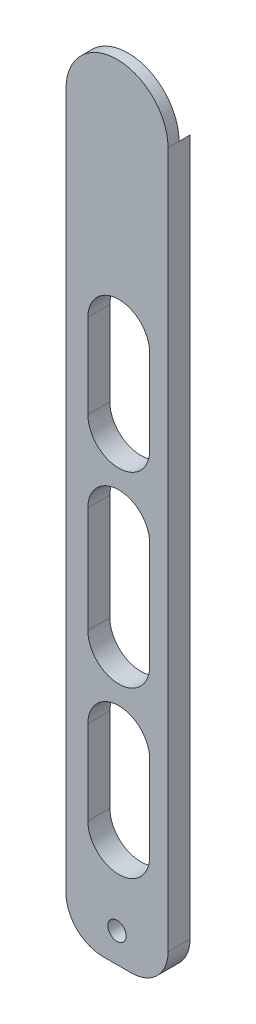
ISO-10303-21;
HEADER;
FILE_DESCRIPTION(('STEP AP214'),'2;1');
FILE_NAME('part.step','',(''),(''),'','','');
FILE_SCHEMA(('AUTOMOTIVE_DESIGN { 1 0 10303 214 1 1 1 1 }'));
ENDSEC;
DATA;
#1=APPLICATION_CONTEXT('core data for automotive mechanical design processes');
#2=APPLICATION_PROTOCOL_DEFINITION('international standard','automotive_design',2000,#1);
#3=PRODUCT_CONTEXT('',#1,'mechanical');
#4=PRODUCT('Part','Part','',(#3));
#5=PRODUCT_RELATED_PRODUCT_CATEGORY('part','',(#4));
#6=PRODUCT_DEFINITION_FORMATION('','',#4);
#7=PRODUCT_DEFINITION_CONTEXT('part definition',#1,'design');
#8=PRODUCT_DEFINITION('design','',#6,#7);
#9=PRODUCT_DEFINITION_SHAPE('','',#8);
#10=(LENGTH_UNIT() NAMED_UNIT(*) SI_UNIT(.MILLI.,.METRE.));
#11=(NAMED_UNIT(*) PLANE_ANGLE_UNIT() SI_UNIT($,.RADIAN.));
#12=(NAMED_UNIT(*) SI_UNIT($,.STERADIAN.) SOLID_ANGLE_UNIT());
#13=UNCERTAINTY_MEASURE_WITH_UNIT(LENGTH_MEASURE(1.E-05),#10,'distance_accuracy_value','');
#14=(GEOMETRIC_REPRESENTATION_CONTEXT(3) GLOBAL_UNCERTAINTY_ASSIGNED_CONTEXT((#13)) GLOBAL_UNIT_ASSIGNED_CONTEXT((#10,
#11,#12)) REPRESENTATION_CONTEXT('',''));
#15=CARTESIAN_POINT('',(0.,0.,0.));
#16=DIRECTION('',(0.,0.,1.));
#17=DIRECTION('',(1.,0.,0.));
#18=AXIS2_PLACEMENT_3D('',#15,#16,#17);
#19=CARTESIAN_POINT('',(0.186190476190486,-158.237738095238,6.));
#20=DIRECTION('',(0.,0.,1.));
#21=DIRECTION('',(1.,0.,0.));
#22=AXIS2_PLACEMENT_3D('',#19,#20,#21);
#23=CYLINDRICAL_SURFACE('',#22,10.);
#24=DIRECTION('',(0.,0.,1.));
#25=VECTOR('',#24,1.);
#26=CARTESIAN_POINT('',(-9.81380952380951,-158.237738095238,6.));
#27=LINE('',#26,#25);
#28=CARTESIAN_POINT('',(-9.81380952380951,-158.237738095238,0.));
#29=VERTEX_POINT('',#28);
#30=CARTESIAN_POINT('',(-9.81380952380951,-158.237738095238,6.));
#31=VERTEX_POINT('',#30);
#32=EDGE_CURVE('E318',#29,#31,#27,.T.);
#33=ORIENTED_EDGE('',*,*,#32,.F.);
#34=CARTESIAN_POINT('',(0.186190476190486,-158.237738095238,0.));
#35=DIRECTION('',(0.,0.,1.));
#36=DIRECTION('',(1.,0.,0.));
#37=AXIS2_PLACEMENT_3D('',#34,#35,#36);
#38=CIRCLE('',#37,10.);
#39=CARTESIAN_POINT('',(0.186190476190486,-168.237738095238,0.));
#40=VERTEX_POINT('',#39);
#41=EDGE_CURVE('E42',#40,#29,#38,.F.);
#42=ORIENTED_EDGE('',*,*,#41,.F.);
#43=DIRECTION('',(0.,0.,1.));
#44=VECTOR('',#43,1.);
#45=CARTESIAN_POINT('',(0.186190476190486,-168.237738095238,6.));
#46=LINE('',#45,#44);
#47=CARTESIAN_POINT('',(0.186190476190486,-168.237738095238,6.));
#48=VERTEX_POINT('',#47);
#49=EDGE_CURVE('E321',#48,#40,#46,.F.);
#50=ORIENTED_EDGE('',*,*,#49,.F.);
#51=CARTESIAN_POINT('',(0.186190476190486,-158.237738095238,6.));
#52=DIRECTION('',(0.,0.,1.));
#53=DIRECTION('',(1.,0.,0.));
#54=AXIS2_PLACEMENT_3D('',#51,#52,#53);
#55=CIRCLE('',#54,10.);
#56=EDGE_CURVE('E11',#31,#48,#55,.T.);
#57=ORIENTED_EDGE('',*,*,#56,.F.);
#58=EDGE_LOOP('',(#33,#42,#50,#57));
#59=FACE_BOUND('',#58,.T.);
#60=ADVANCED_FACE('F35',(#59),#23,.T.);
#61=CARTESIAN_POINT('',(8.03619047619048,-158.237738095238,6.));
#62=DIRECTION('',(0.,0.,-1.));
#63=DIRECTION('',(-1.,0.,0.));
#64=AXIS2_PLACEMENT_3D('',#61,#62,#63);
#65=CYLINDRICAL_SURFACE('',#64,10.);
#66=DIRECTION('',(0.,0.,1.));
#67=VECTOR('',#66,1.);
#68=CARTESIAN_POINT('',(8.03619047619048,-168.237738095238,6.));
#69=LINE('',#68,#67);
#70=CARTESIAN_POINT('',(8.03619047619048,-168.237738095238,0.));
#71=VERTEX_POINT('',#70);
#72=CARTESIAN_POINT('',(8.03619047619048,-168.237738095238,6.));
#73=VERTEX_POINT('',#72);
#74=EDGE_CURVE('E307',#71,#73,#69,.T.);
#75=ORIENTED_EDGE('',*,*,#74,.F.);
#76=CARTESIAN_POINT('',(8.03619047619048,-158.237738095238,0.));
#77=DIRECTION('',(0.,0.,1.));
#78=DIRECTION('',(1.,0.,0.));
#79=AXIS2_PLACEMENT_3D('',#76,#77,#78);
#80=CIRCLE('',#79,10.);
#81=CARTESIAN_POINT('',(18.0361904761905,-158.237738095238,0.));
#82=VERTEX_POINT('',#81);
#83=EDGE_CURVE('E313',#82,#71,#80,.F.);
#84=ORIENTED_EDGE('',*,*,#83,.F.);
#85=DIRECTION('',(0.,0.,1.));
#86=VECTOR('',#85,1.);
#87=CARTESIAN_POINT('',(18.0361904761905,-158.237738095238,6.));
#88=LINE('',#87,#86);
#89=CARTESIAN_POINT('',(18.0361904761905,-158.237738095238,6.));
#90=VERTEX_POINT('',#89);
#91=EDGE_CURVE('E310',#90,#82,#88,.F.);
#92=ORIENTED_EDGE('',*,*,#91,.F.);
#93=CARTESIAN_POINT('',(8.03619047619048,-158.237738095238,6.));
#94=DIRECTION('',(0.,0.,1.));
#95=DIRECTION('',(1.,0.,0.));
#96=AXIS2_PLACEMENT_3D('',#93,#94,#95);
#97=CIRCLE('',#96,10.);
#98=EDGE_CURVE('E316',#73,#90,#97,.T.);
#99=ORIENTED_EDGE('',*,*,#98,.F.);
#100=EDGE_LOOP('',(#75,#84,#92,#99));
#101=FACE_BOUND('',#100,.T.);
#102=ADVANCED_FACE('F348',(#101),#65,.T.);
#103=CARTESIAN_POINT('',(0.,0.,6.));
#104=DIRECTION('',(0.,0.,1.));
#105=DIRECTION('',(1.,0.,0.));
#106=AXIS2_PLACEMENT_3D('',#103,#104,#105);
#107=PLANE('',#106);
#108=CARTESIAN_POINT('',(4.60119047619047,-93.2377380952381,6.));
#109=DIRECTION('',(0.,0.,1.));
#110=DIRECTION('',(1.,0.,0.));
#111=AXIS2_PLACEMENT_3D('',#108,#109,#110);
#112=CIRCLE('',#111,8.435);
#113=CARTESIAN_POINT('',(-3.83380952380953,-93.2377380952381,6.));
#114=VERTEX_POINT('',#113);
#115=CARTESIAN_POINT('',(13.0361904761905,-93.2377380952381,6.));
#116=VERTEX_POINT('',#115);
#117=EDGE_CURVE('E232',#114,#116,#112,.T.);
#118=ORIENTED_EDGE('',*,*,#117,.F.);
#119=DIRECTION('',(0.,-1.,0.));
#120=VECTOR('',#119,1.);
#121=CARTESIAN_POINT('',(-3.83380952380953,0.,6.));
#122=LINE('',#121,#120);
#123=CARTESIAN_POINT('',(-3.83380952380953,-64.2377380952381,6.));
#124=VERTEX_POINT('',#123);
#125=EDGE_CURVE('E218',#124,#114,#122,.T.);
#126=ORIENTED_EDGE('',*,*,#125,.F.);
#127=CARTESIAN_POINT('',(4.60119047619047,-64.2377380952381,6.));
#128=DIRECTION('',(0.,0.,1.));
#129=DIRECTION('',(1.,0.,0.));
#130=AXIS2_PLACEMENT_3D('',#127,#128,#129);
#131=CIRCLE('',#130,8.435);
#132=CARTESIAN_POINT('',(13.0361904761905,-64.2377380952381,6.));
#133=VERTEX_POINT('',#132);
#134=EDGE_CURVE('E226',#133,#124,#131,.T.);
#135=ORIENTED_EDGE('',*,*,#134,.F.);
#136=DIRECTION('',(0.,-1.,0.));
#137=VECTOR('',#136,1.);
#138=CARTESIAN_POINT('',(13.0361904761905,0.,6.));
#139=LINE('',#138,#137);
#140=EDGE_CURVE('E229',#133,#116,#139,.T.);
#141=ORIENTED_EDGE('',*,*,#140,.T.);
#142=EDGE_LOOP('',(#118,#126,#135,#141));
#143=FACE_BOUND('',#142,.T.);
#144=CARTESIAN_POINT('',(4.11119047619046,-160.237738095238,6.));
#145=DIRECTION('',(0.,0.,1.));
#146=DIRECTION('',(1.,0.,0.));
#147=AXIS2_PLACEMENT_3D('',#144,#145,#146);
#148=CIRCLE('',#147,2.5);
#149=CARTESIAN_POINT('',(6.61119047619046,-160.237738095238,6.));
#150=VERTEX_POINT('',#149);
#151=EDGE_CURVE('E275',#150,#150,#148,.T.);
#152=ORIENTED_EDGE('',*,*,#151,.F.);
#153=EDGE_LOOP('',(#152));
#154=FACE_BOUND('',#153,.T.);
#155=DIRECTION('',(0.,-1.,0.));
#156=VECTOR('',#155,1.);
#157=CARTESIAN_POINT('',(-9.81380952380953,0.,6.));
#158=LINE('',#157,#156);
#159=CARTESIAN_POINT('',(-9.81380952380954,31.7622619047619,6.));
#160=VERTEX_POINT('',#159);
#161=EDGE_CURVE('E285',#160,#31,#158,.T.);
#162=ORIENTED_EDGE('',*,*,#161,.T.);
#163=ORIENTED_EDGE('',*,*,#56,.T.);
#164=DIRECTION('',(1.,0.,0.));
#165=VECTOR('',#164,1.);
#166=CARTESIAN_POINT('',(0.,-168.237738095238,6.));
#167=LINE('',#166,#165);
#168=EDGE_CURVE('E287',#48,#73,#167,.T.);
#169=ORIENTED_EDGE('',*,*,#168,.T.);
#170=ORIENTED_EDGE('',*,*,#98,.T.);
#171=DIRECTION('',(0.,-1.,0.));
#172=VECTOR('',#171,1.);
#173=CARTESIAN_POINT('',(18.0361904761905,0.,6.));
#174=LINE('',#173,#172);
#175=CARTESIAN_POINT('',(18.0361904761905,31.7622619047619,6.));
#176=VERTEX_POINT('',#175);
#177=EDGE_CURVE('E279',#176,#90,#174,.T.);
#178=ORIENTED_EDGE('',*,*,#177,.F.);
#179=CARTESIAN_POINT('',(4.11119047619046,31.7622619047619,6.));
#180=DIRECTION('',(0.,0.,1.));
#181=DIRECTION('',(1.,0.,0.));
#182=AXIS2_PLACEMENT_3D('',#179,#180,#181);
#183=CIRCLE('',#182,13.925);
#184=EDGE_CURVE('E282',#176,#160,#183,.T.);
#185=ORIENTED_EDGE('',*,*,#184,.T.);
#186=EDGE_LOOP('',(#162,#163,#169,#170,#178,#185));
#187=FACE_BOUND('',#186,.T.);
#188=DIRECTION('',(0.,1.,0.));
#189=VECTOR('',#188,1.);
#190=CARTESIAN_POINT('',(-3.83380952380953,0.,6.));
#191=LINE('',#190,#189);
#192=CARTESIAN_POINT('',(-3.83380952380953,-138.237738095238,6.));
#193=VERTEX_POINT('',#192);
#194=CARTESIAN_POINT('',(-3.83380952380953,-115.237738095238,6.));
#195=VERTEX_POINT('',#194);
#196=EDGE_CURVE('E260',#193,#195,#191,.T.);
#197=ORIENTED_EDGE('',*,*,#196,.T.);
#198=CARTESIAN_POINT('',(4.60119047619047,-115.237738095238,6.));
#199=DIRECTION('',(0.,0.,1.));
#200=DIRECTION('',(1.,0.,0.));
#201=AXIS2_PLACEMENT_3D('',#198,#199,#200);
#202=CIRCLE('',#201,8.435);
#203=CARTESIAN_POINT('',(13.0361904761905,-115.237738095238,6.));
#204=VERTEX_POINT('',#203);
#205=EDGE_CURVE('E263',#195,#204,#202,.F.);
#206=ORIENTED_EDGE('',*,*,#205,.T.);
#207=DIRECTION('',(0.,1.,0.));
#208=VECTOR('',#207,1.);
#209=CARTESIAN_POINT('',(13.0361904761904,0.,6.));
#210=LINE('',#209,#208);
#211=CARTESIAN_POINT('',(13.0361904761905,-138.237738095238,6.));
#212=VERTEX_POINT('',#211);
#213=EDGE_CURVE('E249',#212,#204,#210,.T.);
#214=ORIENTED_EDGE('',*,*,#213,.F.);
#215=CARTESIAN_POINT('',(4.60119047619047,-138.237738095238,6.));
#216=DIRECTION('',(0.,0.,1.));
#217=DIRECTION('',(1.,0.,0.));
#218=AXIS2_PLACEMENT_3D('',#215,#216,#217);
#219=CIRCLE('',#218,8.435);
#220=EDGE_CURVE('E257',#193,#212,#219,.T.);
#221=ORIENTED_EDGE('',*,*,#220,.F.);
#222=EDGE_LOOP('',(#197,#206,#214,#221));
#223=FACE_BOUND('',#222,.T.);
#224=DIRECTION('',(0.,1.,0.));
#225=VECTOR('',#224,1.);
#226=CARTESIAN_POINT('',(13.0361904761905,0.,6.));
#227=LINE('',#226,#225);
#228=CARTESIAN_POINT('',(13.0361904761905,-42.2377380952381,6.));
#229=VERTEX_POINT('',#228);
#230=CARTESIAN_POINT('',(13.0361904761905,-19.2377380952381,6.));
#231=VERTEX_POINT('',#230);
#232=EDGE_CURVE('E199',#229,#231,#227,.T.);
#233=ORIENTED_EDGE('',*,*,#232,.F.);
#234=CARTESIAN_POINT('',(4.60119047619047,-42.2377380952381,6.));
#235=DIRECTION('',(0.,0.,1.));
#236=DIRECTION('',(1.,0.,0.));
#237=AXIS2_PLACEMENT_3D('',#234,#235,#236);
#238=CIRCLE('',#237,8.435);
#239=CARTESIAN_POINT('',(-3.83380952380954,-42.2377380952381,6.));
#240=VERTEX_POINT('',#239);
#241=EDGE_CURVE('E201',#229,#240,#238,.F.);
#242=ORIENTED_EDGE('',*,*,#241,.T.);
#243=DIRECTION('',(0.,1.,0.));
#244=VECTOR('',#243,1.);
#245=CARTESIAN_POINT('',(-3.83380952380953,0.,6.));
#246=LINE('',#245,#244);
#247=CARTESIAN_POINT('',(-3.83380952380953,-19.2377380952381,6.));
#248=VERTEX_POINT('',#247);
#249=EDGE_CURVE('E194',#240,#248,#246,.T.);
#250=ORIENTED_EDGE('',*,*,#249,.T.);
#251=CARTESIAN_POINT('',(4.60119047619047,-19.2377380952381,6.));
#252=DIRECTION('',(0.,0.,1.));
#253=DIRECTION('',(1.,0.,0.));
#254=AXIS2_PLACEMENT_3D('',#251,#252,#253);
#255=CIRCLE('',#254,8.435);
#256=EDGE_CURVE('E170',#231,#248,#255,.T.);
#257=ORIENTED_EDGE('',*,*,#256,.F.);
#258=EDGE_LOOP('',(#233,#242,#250,#257));
#259=FACE_BOUND('',#258,.T.);
#260=ADVANCED_FACE('F352',(#143,#154,#187,#223,#259),#107,.T.);
#261=CARTESIAN_POINT('',(0.,0.,0.));
#262=DIRECTION('',(0.,0.,1.));
#263=DIRECTION('',(1.,0.,0.));
#264=AXIS2_PLACEMENT_3D('',#261,#262,#263);
#265=PLANE('',#264);
#266=CARTESIAN_POINT('',(4.60119047619047,-115.237738095238,0.));
#267=DIRECTION('',(0.,0.,-1.));
#268=DIRECTION('',(-1.,0.,0.));
#269=AXIS2_PLACEMENT_3D('',#266,#267,#268);
#270=CIRCLE('',#269,8.435);
#271=CARTESIAN_POINT('',(13.0361904761905,-115.237738095238,0.));
#272=VERTEX_POINT('',#271);
#273=CARTESIAN_POINT('',(-3.83380952380953,-115.237738095238,0.));
#274=VERTEX_POINT('',#273);
#275=EDGE_CURVE('E234',#272,#274,#270,.F.);
#276=ORIENTED_EDGE('',*,*,#275,.T.);
#277=DIRECTION('',(0.,-1.,0.));
#278=VECTOR('',#277,1.);
#279=CARTESIAN_POINT('',(-3.83380952380953,0.,0.));
#280=LINE('',#279,#278);
#281=CARTESIAN_POINT('',(-3.83380952380953,-138.237738095238,0.));
#282=VERTEX_POINT('',#281);
#283=EDGE_CURVE('E243',#274,#282,#280,.T.);
#284=ORIENTED_EDGE('',*,*,#283,.T.);
#285=CARTESIAN_POINT('',(4.60119047619047,-138.237738095238,0.));
#286=DIRECTION('',(0.,0.,-1.));
#287=DIRECTION('',(-1.,0.,0.));
#288=AXIS2_PLACEMENT_3D('',#285,#286,#287);
#289=CIRCLE('',#288,8.435);
#290=CARTESIAN_POINT('',(13.0361904761905,-138.237738095238,0.));
#291=VERTEX_POINT('',#290);
#292=EDGE_CURVE('E240',#291,#282,#289,.T.);
#293=ORIENTED_EDGE('',*,*,#292,.F.);
#294=DIRECTION('',(0.,-1.,0.));
#295=VECTOR('',#294,1.);
#296=CARTESIAN_POINT('',(13.0361904761904,0.,0.));
#297=LINE('',#296,#295);
#298=EDGE_CURVE('E237',#272,#291,#297,.T.);
#299=ORIENTED_EDGE('',*,*,#298,.F.);
#300=EDGE_LOOP('',(#276,#284,#293,#299));
#301=FACE_BOUND('',#300,.T.);
#302=CARTESIAN_POINT('',(4.11119047619046,-160.237738095238,0.));
#303=DIRECTION('',(0.,0.,1.));
#304=DIRECTION('',(1.,0.,0.));
#305=AXIS2_PLACEMENT_3D('',#302,#303,#304);
#306=CIRCLE('',#305,2.5);
#307=CARTESIAN_POINT('',(6.61119047619046,-160.237738095238,0.));
#308=VERTEX_POINT('',#307);
#309=EDGE_CURVE('E278',#308,#308,#306,.T.);
#310=ORIENTED_EDGE('',*,*,#309,.T.);
#311=EDGE_LOOP('',(#310));
#312=FACE_BOUND('',#311,.T.);
#313=DIRECTION('',(1.,0.,0.));
#314=VECTOR('',#313,1.);
#315=CARTESIAN_POINT('',(0.,-168.237738095238,0.));
#316=LINE('',#315,#314);
#317=EDGE_CURVE('E283',#40,#71,#316,.T.);
#318=ORIENTED_EDGE('',*,*,#317,.F.);
#319=ORIENTED_EDGE('',*,*,#41,.T.);
#320=DIRECTION('',(0.,-1.,0.));
#321=VECTOR('',#320,1.);
#322=CARTESIAN_POINT('',(-9.81380952380953,0.,0.));
#323=LINE('',#322,#321);
#324=CARTESIAN_POINT('',(-9.81380952380954,31.7622619047619,0.));
#325=VERTEX_POINT('',#324);
#326=EDGE_CURVE('E293',#325,#29,#323,.T.);
#327=ORIENTED_EDGE('',*,*,#326,.F.);
#328=CARTESIAN_POINT('',(4.11119047619046,31.7622619047619,0.));
#329=DIRECTION('',(0.,0.,1.));
#330=DIRECTION('',(1.,0.,0.));
#331=AXIS2_PLACEMENT_3D('',#328,#329,#330);
#332=CIRCLE('',#331,13.925);
#333=CARTESIAN_POINT('',(18.0361904761905,31.7622619047619,0.));
#334=VERTEX_POINT('',#333);
#335=EDGE_CURVE('E302',#325,#334,#332,.T.);
#336=ORIENTED_EDGE('',*,*,#335,.T.);
#337=DIRECTION('',(0.,-1.,0.));
#338=VECTOR('',#337,1.);
#339=CARTESIAN_POINT('',(18.0361904761905,0.,0.));
#340=LINE('',#339,#338);
#341=EDGE_CURVE('E290',#334,#82,#340,.T.);
#342=ORIENTED_EDGE('',*,*,#341,.T.);
#343=ORIENTED_EDGE('',*,*,#83,.T.);
#344=EDGE_LOOP('',(#318,#319,#327,#336,#342,#343));
#345=FACE_BOUND('',#344,.T.);
#346=DIRECTION('',(0.,1.,0.));
#347=VECTOR('',#346,1.);
#348=CARTESIAN_POINT('',(-3.83380952380953,0.,0.));
#349=LINE('',#348,#347);
#350=CARTESIAN_POINT('',(-3.83380952380953,-93.2377380952381,0.));
#351=VERTEX_POINT('',#350);
#352=CARTESIAN_POINT('',(-3.83380952380953,-64.2377380952381,0.));
#353=VERTEX_POINT('',#352);
#354=EDGE_CURVE('E206',#351,#353,#349,.T.);
#355=ORIENTED_EDGE('',*,*,#354,.F.);
#356=CARTESIAN_POINT('',(4.60119047619047,-93.2377380952381,0.));
#357=DIRECTION('',(0.,0.,-1.));
#358=DIRECTION('',(-1.,0.,0.));
#359=AXIS2_PLACEMENT_3D('',#356,#357,#358);
#360=CIRCLE('',#359,8.435);
#361=CARTESIAN_POINT('',(13.0361904761905,-93.2377380952381,0.));
#362=VERTEX_POINT('',#361);
#363=EDGE_CURVE('E204',#362,#351,#360,.T.);
#364=ORIENTED_EDGE('',*,*,#363,.F.);
#365=DIRECTION('',(0.,1.,0.));
#366=VECTOR('',#365,1.);
#367=CARTESIAN_POINT('',(13.0361904761905,0.,0.));
#368=LINE('',#367,#366);
#369=CARTESIAN_POINT('',(13.0361904761905,-64.2377380952381,0.));
#370=VERTEX_POINT('',#369);
#371=EDGE_CURVE('E212',#362,#370,#368,.T.);
#372=ORIENTED_EDGE('',*,*,#371,.T.);
#373=CARTESIAN_POINT('',(4.60119047619047,-64.2377380952381,0.));
#374=DIRECTION('',(0.,0.,-1.));
#375=DIRECTION('',(-1.,0.,0.));
#376=AXIS2_PLACEMENT_3D('',#373,#374,#375);
#377=CIRCLE('',#376,8.435);
#378=EDGE_CURVE('E209',#353,#370,#377,.T.);
#379=ORIENTED_EDGE('',*,*,#378,.F.);
#380=EDGE_LOOP('',(#355,#364,#372,#379));
#381=FACE_BOUND('',#380,.T.);
#382=CARTESIAN_POINT('',(4.60119047619047,-42.2377380952381,0.));
#383=DIRECTION('',(0.,0.,-1.));
#384=DIRECTION('',(-1.,0.,0.));
#385=AXIS2_PLACEMENT_3D('',#382,#383,#384);
#386=CIRCLE('',#385,8.435);
#387=CARTESIAN_POINT('',(-3.83380952380954,-42.2377380952381,0.));
#388=VERTEX_POINT('',#387);
#389=CARTESIAN_POINT('',(13.0361904761905,-42.2377380952381,0.));
#390=VERTEX_POINT('',#389);
#391=EDGE_CURVE('E183',#388,#390,#386,.F.);
#392=ORIENTED_EDGE('',*,*,#391,.T.);
#393=DIRECTION('',(0.,-1.,0.));
#394=VECTOR('',#393,1.);
#395=CARTESIAN_POINT('',(13.0361904761905,0.,0.));
#396=LINE('',#395,#394);
#397=CARTESIAN_POINT('',(13.0361904761905,-19.2377380952381,0.));
#398=VERTEX_POINT('',#397);
#399=EDGE_CURVE('E187',#398,#390,#396,.T.);
#400=ORIENTED_EDGE('',*,*,#399,.F.);
#401=CARTESIAN_POINT('',(4.60119047619047,-19.2377380952381,0.));
#402=DIRECTION('',(0.,0.,-1.));
#403=DIRECTION('',(-1.,0.,0.));
#404=AXIS2_PLACEMENT_3D('',#401,#402,#403);
#405=CIRCLE('',#404,8.435);
#406=CARTESIAN_POINT('',(-3.83380952380953,-19.2377380952381,0.));
#407=VERTEX_POINT('',#406);
#408=EDGE_CURVE('E167',#407,#398,#405,.T.);
#409=ORIENTED_EDGE('',*,*,#408,.F.);
#410=DIRECTION('',(0.,-1.,0.));
#411=VECTOR('',#410,1.);
#412=CARTESIAN_POINT('',(-3.83380952380953,0.,0.));
#413=LINE('',#412,#411);
#414=EDGE_CURVE('E178',#407,#388,#413,.T.);
#415=ORIENTED_EDGE('',*,*,#414,.T.);
#416=EDGE_LOOP('',(#392,#400,#409,#415));
#417=FACE_BOUND('',#416,.T.);
#418=ADVANCED_FACE('F185',(#301,#312,#345,#381,#417),#265,.F.);
#419=CARTESIAN_POINT('',(4.11119047619046,31.7622619047619,6.));
#420=DIRECTION('',(0.,0.,-1.));
#421=DIRECTION('',(-1.,0.,0.));
#422=AXIS2_PLACEMENT_3D('',#419,#420,#421);
#423=CYLINDRICAL_SURFACE('',#422,13.925);
#424=CARTESIAN_POINT('',(4.11119047619046,31.7622619047619,3.));
#425=DIRECTION('',(0.,0.,-1.));
#426=DIRECTION('',(-1.,0.,0.));
#427=AXIS2_PLACEMENT_3D('',#424,#425,#426);
#428=CIRCLE('',#427,13.925);
#429=CARTESIAN_POINT('',(-9.81380952380954,31.7622619047619,3.));
#430=VERTEX_POINT('',#429);
#431=CARTESIAN_POINT('',(18.0361904761905,31.7622619047619,3.));
#432=VERTEX_POINT('',#431);
#433=EDGE_CURVE('E267',#430,#432,#428,.T.);
#434=ORIENTED_EDGE('',*,*,#433,.F.);
#435=DIRECTION('',(0.,0.,-1.));
#436=VECTOR('',#435,1.);
#437=CARTESIAN_POINT('',(-9.81380952380954,31.7622619047619,6.));
#438=LINE('',#437,#436);
#439=EDGE_CURVE('E289',#160,#430,#438,.T.);
#440=ORIENTED_EDGE('',*,*,#439,.F.);
#441=ORIENTED_EDGE('',*,*,#184,.F.);
#442=DIRECTION('',(0.,0.,-1.));
#443=VECTOR('',#442,1.);
#444=CARTESIAN_POINT('',(18.0361904761905,31.7622619047619,6.));
#445=LINE('',#444,#443);
#446=EDGE_CURVE('E299',#176,#432,#445,.T.);
#447=ORIENTED_EDGE('',*,*,#446,.T.);
#448=EDGE_LOOP('',(#434,#440,#441,#447));
#449=FACE_BOUND('',#448,.T.);
#450=ADVANCED_FACE('F338',(#449),#423,.T.);
#451=CARTESIAN_POINT('',(18.0361904761905,0.,6.));
#452=DIRECTION('',(1.,0.,0.));
#453=DIRECTION('',(0.,1.,0.));
#454=AXIS2_PLACEMENT_3D('',#451,#452,#453);
#455=PLANE('',#454);
#456=ORIENTED_EDGE('',*,*,#177,.T.);
#457=ORIENTED_EDGE('',*,*,#91,.T.);
#458=ORIENTED_EDGE('',*,*,#341,.F.);
#459=DIRECTION('',(0.,0.,-1.));
#460=VECTOR('',#459,1.);
#461=CARTESIAN_POINT('',(18.0361904761905,31.7622619047619,3.));
#462=LINE('',#461,#460);
#463=EDGE_CURVE('E273',#432,#334,#462,.T.);
#464=ORIENTED_EDGE('',*,*,#463,.F.);
#465=ORIENTED_EDGE('',*,*,#446,.F.);
#466=EDGE_LOOP('',(#456,#457,#458,#464,#465));
#467=FACE_BOUND('',#466,.T.);
#468=ADVANCED_FACE('F342',(#467),#455,.T.);
#469=CARTESIAN_POINT('',(-9.81380952380953,0.,6.));
#470=DIRECTION('',(1.,0.,0.));
#471=DIRECTION('',(0.,1.,0.));
#472=AXIS2_PLACEMENT_3D('',#469,#470,#471);
#473=PLANE('',#472);
#474=ORIENTED_EDGE('',*,*,#326,.T.);
#475=ORIENTED_EDGE('',*,*,#32,.T.);
#476=ORIENTED_EDGE('',*,*,#161,.F.);
#477=ORIENTED_EDGE('',*,*,#439,.T.);
#478=DIRECTION('',(0.,0.,-1.));
#479=VECTOR('',#478,1.);
#480=CARTESIAN_POINT('',(-9.81380952380954,31.7622619047619,3.));
#481=LINE('',#480,#479);
#482=EDGE_CURVE('E270',#430,#325,#481,.T.);
#483=ORIENTED_EDGE('',*,*,#482,.T.);
#484=EDGE_LOOP('',(#474,#475,#476,#477,#483));
#485=FACE_BOUND('',#484,.T.);
#486=ADVANCED_FACE('F328',(#485),#473,.F.);
#487=CARTESIAN_POINT('',(0.,-168.237738095238,6.));
#488=DIRECTION('',(0.,1.,0.));
#489=DIRECTION('',(0.,0.,1.));
#490=AXIS2_PLACEMENT_3D('',#487,#488,#489);
#491=PLANE('',#490);
#492=ORIENTED_EDGE('',*,*,#168,.F.);
#493=ORIENTED_EDGE('',*,*,#49,.T.);
#494=ORIENTED_EDGE('',*,*,#317,.T.);
#495=ORIENTED_EDGE('',*,*,#74,.T.);
#496=EDGE_LOOP('',(#492,#493,#494,#495));
#497=FACE_BOUND('',#496,.T.);
#498=ADVANCED_FACE('F351',(#497),#491,.F.);
#499=CARTESIAN_POINT('',(4.11119047619046,-160.237738095238,-23.));
#500=DIRECTION('',(0.,0.,1.));
#501=DIRECTION('',(1.,0.,0.));
#502=AXIS2_PLACEMENT_3D('',#499,#500,#501);
#503=CYLINDRICAL_SURFACE('',#502,2.5);
#504=ORIENTED_EDGE('',*,*,#151,.T.);
#505=EDGE_LOOP('',(#504));
#506=FACE_BOUND('',#505,.T.);
#507=ORIENTED_EDGE('',*,*,#309,.F.);
#508=EDGE_LOOP('',(#507));
#509=FACE_BOUND('',#508,.T.);
#510=ADVANCED_FACE('F395',(#506,#509),#503,.F.);
#511=CARTESIAN_POINT('',(4.11119047619046,31.7622619047619,3.));
#512=DIRECTION('',(0.,0.,-1.));
#513=DIRECTION('',(-1.,0.,0.));
#514=AXIS2_PLACEMENT_3D('',#511,#512,#513);
#515=CYLINDRICAL_SURFACE('',#514,13.925);
#516=ORIENTED_EDGE('',*,*,#463,.T.);
#517=ORIENTED_EDGE('',*,*,#335,.F.);
#518=ORIENTED_EDGE('',*,*,#482,.F.);
#519=EDGE_CURVE('E266',#432,#430,#428,.T.);
#520=ORIENTED_EDGE('',*,*,#519,.F.);
#521=EDGE_LOOP('',(#516,#517,#518,#520));
#522=FACE_BOUND('',#521,.T.);
#523=ADVANCED_FACE('F332',(#522),#515,.F.);
#524=CARTESIAN_POINT('',(4.11119047619046,31.7622619047619,3.));
#525=DIRECTION('',(0.,0.,-1.));
#526=DIRECTION('',(-1.,0.,0.));
#527=AXIS2_PLACEMENT_3D('',#524,#525,#526);
#528=PLANE('',#527);
#529=ORIENTED_EDGE('',*,*,#433,.T.);
#530=ORIENTED_EDGE('',*,*,#519,.T.);
#531=EDGE_LOOP('',(#529,#530));
#532=FACE_BOUND('',#531,.T.);
#533=ADVANCED_FACE('F335',(#532),#528,.T.);
#534=CARTESIAN_POINT('',(4.60119047619047,-115.237738095238,13.));
#535=DIRECTION('',(0.,0.,-1.));
#536=DIRECTION('',(-1.,0.,0.));
#537=AXIS2_PLACEMENT_3D('',#534,#535,#536);
#538=CYLINDRICAL_SURFACE('',#537,8.435);
#539=DIRECTION('',(0.,0.,-1.));
#540=VECTOR('',#539,1.);
#541=CARTESIAN_POINT('',(-3.83380952380953,-115.237738095238,13.));
#542=LINE('',#541,#540);
#543=EDGE_CURVE('E247',#195,#274,#542,.T.);
#544=ORIENTED_EDGE('',*,*,#543,.T.);
#545=ORIENTED_EDGE('',*,*,#275,.F.);
#546=DIRECTION('',(0.,0.,-1.));
#547=VECTOR('',#546,1.);
#548=CARTESIAN_POINT('',(13.0361904761905,-115.237738095238,13.));
#549=LINE('',#548,#547);
#550=EDGE_CURVE('E246',#204,#272,#549,.T.);
#551=ORIENTED_EDGE('',*,*,#550,.F.);
#552=ORIENTED_EDGE('',*,*,#205,.F.);
#553=EDGE_LOOP('',(#544,#545,#551,#552));
#554=FACE_BOUND('',#553,.T.);
#555=ADVANCED_FACE('F406',(#554),#538,.F.);
#556=CARTESIAN_POINT('',(-3.83380952380953,0.,13.));
#557=DIRECTION('',(1.,0.,0.));
#558=DIRECTION('',(0.,1.,0.));
#559=AXIS2_PLACEMENT_3D('',#556,#557,#558);
#560=PLANE('',#559);
#561=DIRECTION('',(0.,0.,-1.));
#562=VECTOR('',#561,1.);
#563=CARTESIAN_POINT('',(-3.83380952380953,-138.237738095238,13.));
#564=LINE('',#563,#562);
#565=EDGE_CURVE('E250',#193,#282,#564,.T.);
#566=ORIENTED_EDGE('',*,*,#565,.T.);
#567=ORIENTED_EDGE('',*,*,#283,.F.);
#568=ORIENTED_EDGE('',*,*,#543,.F.);
#569=ORIENTED_EDGE('',*,*,#196,.F.);
#570=EDGE_LOOP('',(#566,#567,#568,#569));
#571=FACE_BOUND('',#570,.T.);
#572=ADVANCED_FACE('F408',(#571),#560,.T.);
#573=CARTESIAN_POINT('',(4.60119047619047,-138.237738095238,13.));
#574=DIRECTION('',(0.,0.,-1.));
#575=DIRECTION('',(-1.,0.,0.));
#576=AXIS2_PLACEMENT_3D('',#573,#574,#575);
#577=CYLINDRICAL_SURFACE('',#576,8.435);
#578=ORIENTED_EDGE('',*,*,#220,.T.);
#579=DIRECTION('',(0.,0.,-1.));
#580=VECTOR('',#579,1.);
#581=CARTESIAN_POINT('',(13.0361904761905,-138.237738095238,13.));
#582=LINE('',#581,#580);
#583=EDGE_CURVE('E252',#212,#291,#582,.T.);
#584=ORIENTED_EDGE('',*,*,#583,.T.);
#585=ORIENTED_EDGE('',*,*,#292,.T.);
#586=ORIENTED_EDGE('',*,*,#565,.F.);
#587=EDGE_LOOP('',(#578,#584,#585,#586));
#588=FACE_BOUND('',#587,.T.);
#589=ADVANCED_FACE('F414',(#588),#577,.F.);
#590=CARTESIAN_POINT('',(13.0361904761904,0.,13.));
#591=DIRECTION('',(1.,0.,0.));
#592=DIRECTION('',(0.,1.,0.));
#593=AXIS2_PLACEMENT_3D('',#590,#591,#592);
#594=PLANE('',#593);
#595=ORIENTED_EDGE('',*,*,#213,.T.);
#596=ORIENTED_EDGE('',*,*,#550,.T.);
#597=ORIENTED_EDGE('',*,*,#298,.T.);
#598=ORIENTED_EDGE('',*,*,#583,.F.);
#599=EDGE_LOOP('',(#595,#596,#597,#598));
#600=FACE_BOUND('',#599,.T.);
#601=ADVANCED_FACE('F410',(#600),#594,.F.);
#602=CARTESIAN_POINT('',(4.60119047619047,-93.2377380952381,13.));
#603=DIRECTION('',(0.,0.,-1.));
#604=DIRECTION('',(-1.,0.,0.));
#605=AXIS2_PLACEMENT_3D('',#602,#603,#604);
#606=CYLINDRICAL_SURFACE('',#605,8.435);
#607=ORIENTED_EDGE('',*,*,#117,.T.);
#608=DIRECTION('',(0.,0.,-1.));
#609=VECTOR('',#608,1.);
#610=CARTESIAN_POINT('',(13.0361904761905,-93.2377380952381,13.));
#611=LINE('',#610,#609);
#612=EDGE_CURVE('E216',#116,#362,#611,.T.);
#613=ORIENTED_EDGE('',*,*,#612,.T.);
#614=ORIENTED_EDGE('',*,*,#363,.T.);
#615=DIRECTION('',(0.,0.,-1.));
#616=VECTOR('',#615,1.);
#617=CARTESIAN_POINT('',(-3.83380952380953,-93.2377380952381,13.));
#618=LINE('',#617,#616);
#619=EDGE_CURVE('E215',#114,#351,#618,.T.);
#620=ORIENTED_EDGE('',*,*,#619,.F.);
#621=EDGE_LOOP('',(#607,#613,#614,#620));
#622=FACE_BOUND('',#621,.T.);
#623=ADVANCED_FACE('F413',(#622),#606,.F.);
#624=CARTESIAN_POINT('',(13.0361904761905,0.,13.));
#625=DIRECTION('',(-1.,0.,0.));
#626=DIRECTION('',(0.,0.,1.));
#627=AXIS2_PLACEMENT_3D('',#624,#625,#626);
#628=PLANE('',#627);
#629=DIRECTION('',(0.,0.,-1.));
#630=VECTOR('',#629,1.);
#631=CARTESIAN_POINT('',(13.0361904761905,-64.2377380952381,13.));
#632=LINE('',#631,#630);
#633=EDGE_CURVE('E219',#133,#370,#632,.T.);
#634=ORIENTED_EDGE('',*,*,#633,.T.);
#635=ORIENTED_EDGE('',*,*,#371,.F.);
#636=ORIENTED_EDGE('',*,*,#612,.F.);
#637=ORIENTED_EDGE('',*,*,#140,.F.);
#638=EDGE_LOOP('',(#634,#635,#636,#637));
#639=FACE_BOUND('',#638,.T.);
#640=ADVANCED_FACE('F423',(#639),#628,.T.);
#641=CARTESIAN_POINT('',(4.60119047619047,-64.2377380952381,13.));
#642=DIRECTION('',(0.,0.,-1.));
#643=DIRECTION('',(-1.,0.,0.));
#644=AXIS2_PLACEMENT_3D('',#641,#642,#643);
#645=CYLINDRICAL_SURFACE('',#644,8.435);
#646=ORIENTED_EDGE('',*,*,#134,.T.);
#647=DIRECTION('',(0.,0.,-1.));
#648=VECTOR('',#647,1.);
#649=CARTESIAN_POINT('',(-3.83380952380953,-64.2377380952381,13.));
#650=LINE('',#649,#648);
#651=EDGE_CURVE('E221',#124,#353,#650,.T.);
#652=ORIENTED_EDGE('',*,*,#651,.T.);
#653=ORIENTED_EDGE('',*,*,#378,.T.);
#654=ORIENTED_EDGE('',*,*,#633,.F.);
#655=EDGE_LOOP('',(#646,#652,#653,#654));
#656=FACE_BOUND('',#655,.T.);
#657=ADVANCED_FACE('F373',(#656),#645,.F.);
#658=CARTESIAN_POINT('',(-3.83380952380953,0.,13.));
#659=DIRECTION('',(-1.,0.,0.));
#660=DIRECTION('',(0.,0.,1.));
#661=AXIS2_PLACEMENT_3D('',#658,#659,#660);
#662=PLANE('',#661);
#663=ORIENTED_EDGE('',*,*,#125,.T.);
#664=ORIENTED_EDGE('',*,*,#619,.T.);
#665=ORIENTED_EDGE('',*,*,#354,.T.);
#666=ORIENTED_EDGE('',*,*,#651,.F.);
#667=EDGE_LOOP('',(#663,#664,#665,#666));
#668=FACE_BOUND('',#667,.T.);
#669=ADVANCED_FACE('F366',(#668),#662,.F.);
#670=CARTESIAN_POINT('',(4.60119047619047,-42.2377380952381,13.));
#671=DIRECTION('',(0.,0.,-1.));
#672=DIRECTION('',(-1.,0.,0.));
#673=AXIS2_PLACEMENT_3D('',#670,#671,#672);
#674=CYLINDRICAL_SURFACE('',#673,8.435);
#675=DIRECTION('',(0.,0.,-1.));
#676=VECTOR('',#675,1.);
#677=CARTESIAN_POINT('',(13.0361904761905,-42.2377380952381,13.));
#678=LINE('',#677,#676);
#679=EDGE_CURVE('E192',#229,#390,#678,.T.);
#680=ORIENTED_EDGE('',*,*,#679,.T.);
#681=ORIENTED_EDGE('',*,*,#391,.F.);
#682=DIRECTION('',(0.,0.,-1.));
#683=VECTOR('',#682,1.);
#684=CARTESIAN_POINT('',(-3.83380952380954,-42.2377380952381,13.));
#685=LINE('',#684,#683);
#686=EDGE_CURVE('E174',#240,#388,#685,.T.);
#687=ORIENTED_EDGE('',*,*,#686,.F.);
#688=ORIENTED_EDGE('',*,*,#241,.F.);
#689=EDGE_LOOP('',(#680,#681,#687,#688));
#690=FACE_BOUND('',#689,.T.);
#691=ADVANCED_FACE('F364',(#690),#674,.F.);
#692=CARTESIAN_POINT('',(13.0361904761905,0.,13.));
#693=DIRECTION('',(1.,0.,0.));
#694=DIRECTION('',(0.,1.,0.));
#695=AXIS2_PLACEMENT_3D('',#692,#693,#694);
#696=PLANE('',#695);
#697=ORIENTED_EDGE('',*,*,#232,.T.);
#698=DIRECTION('',(0.,0.,-1.));
#699=VECTOR('',#698,1.);
#700=CARTESIAN_POINT('',(13.0361904761905,-19.2377380952381,13.));
#701=LINE('',#700,#699);
#702=EDGE_CURVE('E173',#231,#398,#701,.T.);
#703=ORIENTED_EDGE('',*,*,#702,.T.);
#704=ORIENTED_EDGE('',*,*,#399,.T.);
#705=ORIENTED_EDGE('',*,*,#679,.F.);
#706=EDGE_LOOP('',(#697,#703,#704,#705));
#707=FACE_BOUND('',#706,.T.);
#708=ADVANCED_FACE('F362',(#707),#696,.F.);
#709=CARTESIAN_POINT('',(4.60119047619047,-19.2377380952381,13.));
#710=DIRECTION('',(0.,0.,-1.));
#711=DIRECTION('',(-1.,0.,0.));
#712=AXIS2_PLACEMENT_3D('',#709,#710,#711);
#713=CYLINDRICAL_SURFACE('',#712,8.435);
#714=ORIENTED_EDGE('',*,*,#256,.T.);
#715=DIRECTION('',(0.,0.,-1.));
#716=VECTOR('',#715,1.);
#717=CARTESIAN_POINT('',(-3.83380952380953,-19.2377380952381,13.));
#718=LINE('',#717,#716);
#719=EDGE_CURVE('E162',#248,#407,#718,.T.);
#720=ORIENTED_EDGE('',*,*,#719,.T.);
#721=ORIENTED_EDGE('',*,*,#408,.T.);
#722=ORIENTED_EDGE('',*,*,#702,.F.);
#723=EDGE_LOOP('',(#714,#720,#721,#722));
#724=FACE_BOUND('',#723,.T.);
#725=ADVANCED_FACE('F164',(#724),#713,.F.);
#726=CARTESIAN_POINT('',(-3.83380952380953,0.,13.));
#727=DIRECTION('',(1.,0.,0.));
#728=DIRECTION('',(0.,1.,0.));
#729=AXIS2_PLACEMENT_3D('',#726,#727,#728);
#730=PLANE('',#729);
#731=ORIENTED_EDGE('',*,*,#686,.T.);
#732=ORIENTED_EDGE('',*,*,#414,.F.);
#733=ORIENTED_EDGE('',*,*,#719,.F.);
#734=ORIENTED_EDGE('',*,*,#249,.F.);
#735=EDGE_LOOP('',(#731,#732,#733,#734));
#736=FACE_BOUND('',#735,.T.);
#737=ADVANCED_FACE('F179',(#736),#730,.T.);
#738=CLOSED_SHELL('',(#60,#102,#260,#418,#450,#468,#486,#498,#510,#523,#533,#555,#572,#589,#601,
#623,#640,#657,#669,#691,#708,#725,#737));
#739=MANIFOLD_SOLID_BREP('B2',#738);
#740=ADVANCED_BREP_SHAPE_REPRESENTATION('',(#18,#739),#14);
#741=SHAPE_DEFINITION_REPRESENTATION(#9,#740);
ENDSEC;
END-ISO-10303-21;
